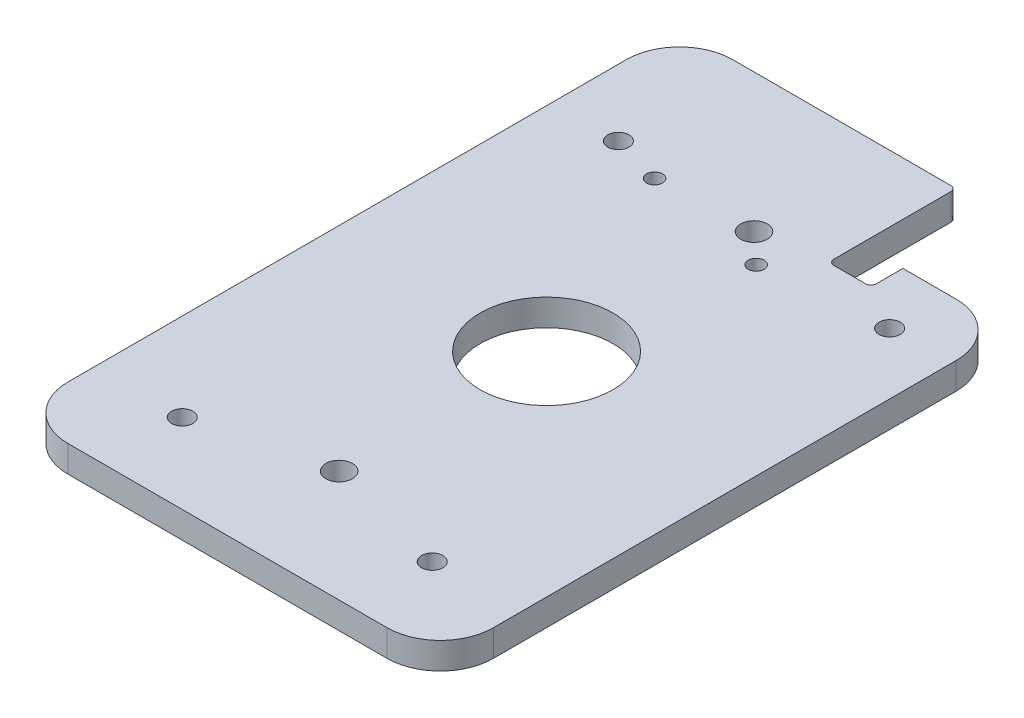
ISO-10303-21;
HEADER;
FILE_DESCRIPTION(('STEP AP214'),'2;1');
FILE_NAME('part.step','',(''),(''),'','','');
FILE_SCHEMA(('AUTOMOTIVE_DESIGN { 1 0 10303 214 1 1 1 1 }'));
ENDSEC;
DATA;
#1=APPLICATION_CONTEXT('core data for automotive mechanical design processes');
#2=APPLICATION_PROTOCOL_DEFINITION('international standard','automotive_design',2000,#1);
#3=PRODUCT_CONTEXT('',#1,'mechanical');
#4=PRODUCT('Part','Part','',(#3));
#5=PRODUCT_RELATED_PRODUCT_CATEGORY('part','',(#4));
#6=PRODUCT_DEFINITION_FORMATION('','',#4);
#7=PRODUCT_DEFINITION_CONTEXT('part definition',#1,'design');
#8=PRODUCT_DEFINITION('design','',#6,#7);
#9=PRODUCT_DEFINITION_SHAPE('','',#8);
#10=(LENGTH_UNIT() NAMED_UNIT(*) SI_UNIT(.MILLI.,.METRE.));
#11=(NAMED_UNIT(*) PLANE_ANGLE_UNIT() SI_UNIT($,.RADIAN.));
#12=(NAMED_UNIT(*) SI_UNIT($,.STERADIAN.) SOLID_ANGLE_UNIT());
#13=UNCERTAINTY_MEASURE_WITH_UNIT(LENGTH_MEASURE(1.E-05),#10,'distance_accuracy_value','');
#14=(GEOMETRIC_REPRESENTATION_CONTEXT(3) GLOBAL_UNCERTAINTY_ASSIGNED_CONTEXT((#13)) GLOBAL_UNIT_ASSIGNED_CONTEXT((#10,
#11,#12)) REPRESENTATION_CONTEXT('',''));
#15=CARTESIAN_POINT('',(0.,0.,0.));
#16=DIRECTION('',(0.,0.,1.));
#17=DIRECTION('',(1.,0.,0.));
#18=AXIS2_PLACEMENT_3D('',#15,#16,#17);
#19=CARTESIAN_POINT('',(0.,5.,0.));
#20=DIRECTION('',(0.,1.,0.));
#21=DIRECTION('',(0.,0.,1.));
#22=AXIS2_PLACEMENT_3D('',#19,#20,#21);
#23=PLANE('',#22);
#24=DIRECTION('',(0.,0.,1.));
#25=VECTOR('',#24,1.);
#26=CARTESIAN_POINT('',(12.,5.,-65.));
#27=LINE('',#26,#25);
#28=CARTESIAN_POINT('',(12.,5.,-64.));
#29=VERTEX_POINT('',#28);
#30=CARTESIAN_POINT('',(12.,5.,-42.));
#31=VERTEX_POINT('',#30);
#32=EDGE_CURVE('E177',#29,#31,#27,.T.);
#33=ORIENTED_EDGE('',*,*,#32,.F.);
#34=CARTESIAN_POINT('',(11.,5.,-64.));
#35=DIRECTION('',(0.,1.,0.));
#36=DIRECTION('',(0.,0.,1.));
#37=AXIS2_PLACEMENT_3D('',#34,#35,#36);
#38=CIRCLE('',#37,1.);
#39=CARTESIAN_POINT('',(11.,5.,-65.));
#40=VERTEX_POINT('',#39);
#41=EDGE_CURVE('E56',#29,#40,#38,.T.);
#42=ORIENTED_EDGE('',*,*,#41,.T.);
#43=DIRECTION('',(-1.,0.,0.));
#44=VECTOR('',#43,1.);
#45=CARTESIAN_POINT('',(-40.,5.,-65.));
#46=LINE('',#45,#44);
#47=CARTESIAN_POINT('',(-30.,5.,-65.));
#48=VERTEX_POINT('',#47);
#49=EDGE_CURVE('E195',#40,#48,#46,.T.);
#50=ORIENTED_EDGE('',*,*,#49,.T.);
#51=CARTESIAN_POINT('',(-30.,5.,-55.));
#52=DIRECTION('',(0.,1.,0.));
#53=DIRECTION('',(0.,0.,1.));
#54=AXIS2_PLACEMENT_3D('',#51,#52,#53);
#55=CIRCLE('',#54,10.);
#56=CARTESIAN_POINT('',(-40.,5.,-55.));
#57=VERTEX_POINT('',#56);
#58=EDGE_CURVE('E212',#48,#57,#55,.T.);
#59=ORIENTED_EDGE('',*,*,#58,.T.);
#60=DIRECTION('',(0.,0.,1.));
#61=VECTOR('',#60,1.);
#62=CARTESIAN_POINT('',(-40.,5.,-65.));
#63=LINE('',#62,#61);
#64=CARTESIAN_POINT('',(-40.,5.,50.));
#65=VERTEX_POINT('',#64);
#66=EDGE_CURVE('E185',#57,#65,#63,.T.);
#67=ORIENTED_EDGE('',*,*,#66,.T.);
#68=CARTESIAN_POINT('',(-30.,5.,50.));
#69=DIRECTION('',(0.,1.,0.));
#70=DIRECTION('',(0.,0.,1.));
#71=AXIS2_PLACEMENT_3D('',#68,#69,#70);
#72=CIRCLE('',#71,10.);
#73=CARTESIAN_POINT('',(-30.,5.,60.));
#74=VERTEX_POINT('',#73);
#75=EDGE_CURVE('E214',#65,#74,#72,.T.);
#76=ORIENTED_EDGE('',*,*,#75,.T.);
#77=DIRECTION('',(1.,0.,0.));
#78=VECTOR('',#77,1.);
#79=CARTESIAN_POINT('',(-40.,5.,60.));
#80=LINE('',#79,#78);
#81=CARTESIAN_POINT('',(30.,5.,60.));
#82=VERTEX_POINT('',#81);
#83=EDGE_CURVE('E188',#74,#82,#80,.T.);
#84=ORIENTED_EDGE('',*,*,#83,.T.);
#85=CARTESIAN_POINT('',(30.,5.,50.));
#86=DIRECTION('',(0.,1.,0.));
#87=DIRECTION('',(0.,0.,1.));
#88=AXIS2_PLACEMENT_3D('',#85,#86,#87);
#89=CIRCLE('',#88,10.);
#90=CARTESIAN_POINT('',(40.,5.,50.));
#91=VERTEX_POINT('',#90);
#92=EDGE_CURVE('E216',#82,#91,#89,.T.);
#93=ORIENTED_EDGE('',*,*,#92,.T.);
#94=DIRECTION('',(0.,0.,-1.));
#95=VECTOR('',#94,1.);
#96=CARTESIAN_POINT('',(40.,5.,-65.));
#97=LINE('',#96,#95);
#98=CARTESIAN_POINT('',(40.,5.,-37.));
#99=VERTEX_POINT('',#98);
#100=EDGE_CURVE('E192',#91,#99,#97,.T.);
#101=ORIENTED_EDGE('',*,*,#100,.T.);
#102=CARTESIAN_POINT('',(30.,5.,-37.));
#103=DIRECTION('',(0.,1.,0.));
#104=DIRECTION('',(0.,0.,1.));
#105=AXIS2_PLACEMENT_3D('',#102,#103,#104);
#106=CIRCLE('',#105,10.);
#107=CARTESIAN_POINT('',(30.,5.,-47.));
#108=VERTEX_POINT('',#107);
#109=EDGE_CURVE('E218',#99,#108,#106,.T.);
#110=ORIENTED_EDGE('',*,*,#109,.T.);
#111=DIRECTION('',(1.,0.,0.));
#112=VECTOR('',#111,1.);
#113=CARTESIAN_POINT('',(12.,5.,-47.));
#114=LINE('',#113,#112);
#115=CARTESIAN_POINT('',(20.,5.,-47.));
#116=VERTEX_POINT('',#115);
#117=EDGE_CURVE('E173',#116,#108,#114,.T.);
#118=ORIENTED_EDGE('',*,*,#117,.F.);
#119=DIRECTION('',(0.,0.,-1.));
#120=VECTOR('',#119,1.);
#121=CARTESIAN_POINT('',(20.,5.,-47.));
#122=LINE('',#121,#120);
#123=CARTESIAN_POINT('',(20.,5.,-42.));
#124=VERTEX_POINT('',#123);
#125=EDGE_CURVE('E157',#124,#116,#122,.T.);
#126=ORIENTED_EDGE('',*,*,#125,.F.);
#127=CARTESIAN_POINT('',(19.,5.,-42.));
#128=DIRECTION('',(0.,1.,0.));
#129=DIRECTION('',(0.,0.,1.));
#130=AXIS2_PLACEMENT_3D('',#127,#128,#129);
#131=CIRCLE('',#130,1.);
#132=CARTESIAN_POINT('',(19.,5.,-41.));
#133=VERTEX_POINT('',#132);
#134=EDGE_CURVE('E260',#124,#133,#131,.F.);
#135=ORIENTED_EDGE('',*,*,#134,.T.);
#136=DIRECTION('',(1.,0.,0.));
#137=VECTOR('',#136,1.);
#138=CARTESIAN_POINT('',(12.,5.,-41.));
#139=LINE('',#138,#137);
#140=CARTESIAN_POINT('',(13.,5.,-41.));
#141=VERTEX_POINT('',#140);
#142=EDGE_CURVE('E265',#141,#133,#139,.T.);
#143=ORIENTED_EDGE('',*,*,#142,.F.);
#144=CARTESIAN_POINT('',(13.,5.,-42.));
#145=DIRECTION('',(0.,1.,0.));
#146=DIRECTION('',(0.,0.,1.));
#147=AXIS2_PLACEMENT_3D('',#144,#145,#146);
#148=CIRCLE('',#147,1.);
#149=EDGE_CURVE('E41',#141,#31,#148,.F.);
#150=ORIENTED_EDGE('',*,*,#149,.T.);
#151=EDGE_LOOP('',(#33,#42,#50,#59,#67,#76,#84,#93,#101,#110,#118,#126,#135,#143,#150));
#152=FACE_BOUND('',#151,.T.);
#153=CARTESIAN_POINT('',(5.60943135797618,5.,-33.8));
#154=DIRECTION('',(0.,1.,0.));
#155=DIRECTION('',(0.,0.,1.));
#156=AXIS2_PLACEMENT_3D('',#153,#154,#155);
#157=CIRCLE('',#156,1.49999999999999);
#158=CARTESIAN_POINT('',(5.60943135797618,5.,-32.3));
#159=VERTEX_POINT('',#158);
#160=EDGE_CURVE('E160',#159,#159,#157,.T.);
#161=ORIENTED_EDGE('',*,*,#160,.F.);
#162=EDGE_LOOP('',(#161));
#163=FACE_BOUND('',#162,.T.);
#164=CARTESIAN_POINT('',(-18.,5.,-38.3));
#165=DIRECTION('',(0.,1.,0.));
#166=DIRECTION('',(0.,0.,1.));
#167=AXIS2_PLACEMENT_3D('',#164,#165,#166);
#168=CIRCLE('',#167,1.49999999999999);
#169=CARTESIAN_POINT('',(-18.,5.,-36.8));
#170=VERTEX_POINT('',#169);
#171=EDGE_CURVE('E288',#170,#170,#168,.T.);
#172=ORIENTED_EDGE('',*,*,#171,.F.);
#173=EDGE_LOOP('',(#172));
#174=FACE_BOUND('',#173,.T.);
#175=CARTESIAN_POINT('',(0.,5.,39.));
#176=DIRECTION('',(0.,1.,0.));
#177=DIRECTION('',(0.,0.,1.));
#178=AXIS2_PLACEMENT_3D('',#175,#176,#177);
#179=CIRCLE('',#178,2.5);
#180=CARTESIAN_POINT('',(0.,5.,41.5));
#181=VERTEX_POINT('',#180);
#182=EDGE_CURVE('E294',#181,#181,#179,.T.);
#183=ORIENTED_EDGE('',*,*,#182,.F.);
#184=EDGE_LOOP('',(#183));
#185=FACE_BOUND('',#184,.T.);
#186=CARTESIAN_POINT('',(0.,5.,-39.));
#187=DIRECTION('',(0.,1.,0.));
#188=DIRECTION('',(0.,0.,1.));
#189=AXIS2_PLACEMENT_3D('',#186,#187,#188);
#190=CIRCLE('',#189,2.5);
#191=CARTESIAN_POINT('',(0.,5.,-36.5));
#192=VERTEX_POINT('',#191);
#193=EDGE_CURVE('E300',#192,#192,#190,.T.);
#194=ORIENTED_EDGE('',*,*,#193,.F.);
#195=EDGE_LOOP('',(#194));
#196=FACE_BOUND('',#195,.T.);
#197=CARTESIAN_POINT('',(-23.4999999999885,5.,45.));
#198=DIRECTION('',(0.,1.,0.));
#199=DIRECTION('',(0.,0.,1.));
#200=AXIS2_PLACEMENT_3D('',#197,#198,#199);
#201=CIRCLE('',#200,1.99999999999999);
#202=CARTESIAN_POINT('',(-23.4999999999885,5.,47.));
#203=VERTEX_POINT('',#202);
#204=EDGE_CURVE('E306',#203,#203,#201,.T.);
#205=ORIENTED_EDGE('',*,*,#204,.F.);
#206=EDGE_LOOP('',(#205));
#207=FACE_BOUND('',#206,.T.);
#208=CARTESIAN_POINT('',(23.4999999999885,5.,45.));
#209=DIRECTION('',(0.,1.,0.));
#210=DIRECTION('',(0.,0.,1.));
#211=AXIS2_PLACEMENT_3D('',#208,#209,#210);
#212=CIRCLE('',#211,1.99999999999999);
#213=CARTESIAN_POINT('',(23.4999999999885,5.,47.));
#214=VERTEX_POINT('',#213);
#215=EDGE_CURVE('E312',#214,#214,#212,.T.);
#216=ORIENTED_EDGE('',*,*,#215,.F.);
#217=EDGE_LOOP('',(#216));
#218=FACE_BOUND('',#217,.T.);
#219=CARTESIAN_POINT('',(28.4999999999885,5.,-36.));
#220=DIRECTION('',(0.,1.,0.));
#221=DIRECTION('',(0.,0.,1.));
#222=AXIS2_PLACEMENT_3D('',#219,#220,#221);
#223=CIRCLE('',#222,1.99999999999999);
#224=CARTESIAN_POINT('',(28.4999999999885,5.,-34.));
#225=VERTEX_POINT('',#224);
#226=EDGE_CURVE('E318',#225,#225,#223,.T.);
#227=ORIENTED_EDGE('',*,*,#226,.F.);
#228=EDGE_LOOP('',(#227));
#229=FACE_BOUND('',#228,.T.);
#230=CARTESIAN_POINT('',(-27.4999999999885,5.,-41.));
#231=DIRECTION('',(0.,1.,0.));
#232=DIRECTION('',(0.,0.,1.));
#233=AXIS2_PLACEMENT_3D('',#230,#231,#232);
#234=CIRCLE('',#233,1.99999999999999);
#235=CARTESIAN_POINT('',(-27.4999999999885,5.,-39.));
#236=VERTEX_POINT('',#235);
#237=EDGE_CURVE('E324',#236,#236,#234,.T.);
#238=ORIENTED_EDGE('',*,*,#237,.F.);
#239=EDGE_LOOP('',(#238));
#240=FACE_BOUND('',#239,.T.);
#241=CARTESIAN_POINT('',(0.,5.,0.));
#242=DIRECTION('',(0.,1.,0.));
#243=DIRECTION('',(0.,0.,1.));
#244=AXIS2_PLACEMENT_3D('',#241,#242,#243);
#245=CIRCLE('',#244,12.5);
#246=CARTESIAN_POINT('',(0.,5.,12.5));
#247=VERTEX_POINT('',#246);
#248=EDGE_CURVE('E170',#247,#247,#245,.T.);
#249=ORIENTED_EDGE('',*,*,#248,.F.);
#250=EDGE_LOOP('',(#249));
#251=FACE_BOUND('',#250,.T.);
#252=ADVANCED_FACE('F33',(#152,#163,#174,#185,#196,#207,#218,#229,#240,#251),#23,.T.);
#253=CARTESIAN_POINT('',(0.,0.,0.));
#254=DIRECTION('',(0.,1.,0.));
#255=DIRECTION('',(0.,0.,1.));
#256=AXIS2_PLACEMENT_3D('',#253,#254,#255);
#257=PLANE('',#256);
#258=DIRECTION('',(-1.,0.,0.));
#259=VECTOR('',#258,1.);
#260=CARTESIAN_POINT('',(-40.,0.,-65.));
#261=LINE('',#260,#259);
#262=CARTESIAN_POINT('',(11.,0.,-65.));
#263=VERTEX_POINT('',#262);
#264=CARTESIAN_POINT('',(-30.,0.,-65.));
#265=VERTEX_POINT('',#264);
#266=EDGE_CURVE('E189',#263,#265,#261,.T.);
#267=ORIENTED_EDGE('',*,*,#266,.F.);
#268=CARTESIAN_POINT('',(11.,0.,-64.));
#269=DIRECTION('',(0.,1.,0.));
#270=DIRECTION('',(0.,0.,1.));
#271=AXIS2_PLACEMENT_3D('',#268,#269,#270);
#272=CIRCLE('',#271,1.);
#273=CARTESIAN_POINT('',(12.,0.,-64.));
#274=VERTEX_POINT('',#273);
#275=EDGE_CURVE('E258',#263,#274,#272,.F.);
#276=ORIENTED_EDGE('',*,*,#275,.T.);
#277=DIRECTION('',(0.,0.,1.));
#278=VECTOR('',#277,1.);
#279=CARTESIAN_POINT('',(12.,0.,-65.));
#280=LINE('',#279,#278);
#281=CARTESIAN_POINT('',(12.,0.,-42.));
#282=VERTEX_POINT('',#281);
#283=EDGE_CURVE('E167',#274,#282,#280,.T.);
#284=ORIENTED_EDGE('',*,*,#283,.T.);
#285=CARTESIAN_POINT('',(13.,0.,-42.));
#286=DIRECTION('',(0.,1.,0.));
#287=DIRECTION('',(0.,0.,1.));
#288=AXIS2_PLACEMENT_3D('',#285,#286,#287);
#289=CIRCLE('',#288,1.);
#290=CARTESIAN_POINT('',(13.,0.,-41.));
#291=VERTEX_POINT('',#290);
#292=EDGE_CURVE('E11',#282,#291,#289,.T.);
#293=ORIENTED_EDGE('',*,*,#292,.T.);
#294=DIRECTION('',(1.,0.,0.));
#295=VECTOR('',#294,1.);
#296=CARTESIAN_POINT('',(12.,0.,-41.));
#297=LINE('',#296,#295);
#298=CARTESIAN_POINT('',(19.,0.,-41.));
#299=VERTEX_POINT('',#298);
#300=EDGE_CURVE('E152',#291,#299,#297,.T.);
#301=ORIENTED_EDGE('',*,*,#300,.T.);
#302=CARTESIAN_POINT('',(19.,0.,-42.));
#303=DIRECTION('',(0.,1.,0.));
#304=DIRECTION('',(0.,0.,1.));
#305=AXIS2_PLACEMENT_3D('',#302,#303,#304);
#306=CIRCLE('',#305,1.);
#307=CARTESIAN_POINT('',(20.,0.,-42.));
#308=VERTEX_POINT('',#307);
#309=EDGE_CURVE('E147',#299,#308,#306,.T.);
#310=ORIENTED_EDGE('',*,*,#309,.T.);
#311=DIRECTION('',(0.,0.,-1.));
#312=VECTOR('',#311,1.);
#313=CARTESIAN_POINT('',(20.,0.,-47.));
#314=LINE('',#313,#312);
#315=CARTESIAN_POINT('',(20.,0.,-47.));
#316=VERTEX_POINT('',#315);
#317=EDGE_CURVE('E138',#308,#316,#314,.T.);
#318=ORIENTED_EDGE('',*,*,#317,.T.);
#319=DIRECTION('',(1.,0.,0.));
#320=VECTOR('',#319,1.);
#321=CARTESIAN_POINT('',(12.,0.,-47.));
#322=LINE('',#321,#320);
#323=CARTESIAN_POINT('',(30.,0.,-47.));
#324=VERTEX_POINT('',#323);
#325=EDGE_CURVE('E143',#316,#324,#322,.T.);
#326=ORIENTED_EDGE('',*,*,#325,.T.);
#327=CARTESIAN_POINT('',(30.,0.,-37.));
#328=DIRECTION('',(0.,1.,0.));
#329=DIRECTION('',(0.,0.,1.));
#330=AXIS2_PLACEMENT_3D('',#327,#328,#329);
#331=CIRCLE('',#330,10.);
#332=CARTESIAN_POINT('',(40.,0.,-37.));
#333=VERTEX_POINT('',#332);
#334=EDGE_CURVE('E229',#324,#333,#331,.F.);
#335=ORIENTED_EDGE('',*,*,#334,.T.);
#336=DIRECTION('',(0.,0.,-1.));
#337=VECTOR('',#336,1.);
#338=CARTESIAN_POINT('',(40.,0.,-65.));
#339=LINE('',#338,#337);
#340=CARTESIAN_POINT('',(40.,0.,50.));
#341=VERTEX_POINT('',#340);
#342=EDGE_CURVE('E203',#341,#333,#339,.T.);
#343=ORIENTED_EDGE('',*,*,#342,.F.);
#344=CARTESIAN_POINT('',(30.,0.,50.));
#345=DIRECTION('',(0.,1.,0.));
#346=DIRECTION('',(0.,0.,1.));
#347=AXIS2_PLACEMENT_3D('',#344,#345,#346);
#348=CIRCLE('',#347,10.);
#349=CARTESIAN_POINT('',(30.,0.,60.));
#350=VERTEX_POINT('',#349);
#351=EDGE_CURVE('E227',#341,#350,#348,.F.);
#352=ORIENTED_EDGE('',*,*,#351,.T.);
#353=DIRECTION('',(1.,0.,0.));
#354=VECTOR('',#353,1.);
#355=CARTESIAN_POINT('',(-40.,0.,60.));
#356=LINE('',#355,#354);
#357=CARTESIAN_POINT('',(-30.,0.,60.));
#358=VERTEX_POINT('',#357);
#359=EDGE_CURVE('E200',#358,#350,#356,.T.);
#360=ORIENTED_EDGE('',*,*,#359,.F.);
#361=CARTESIAN_POINT('',(-30.,0.,50.));
#362=DIRECTION('',(0.,1.,0.));
#363=DIRECTION('',(0.,0.,1.));
#364=AXIS2_PLACEMENT_3D('',#361,#362,#363);
#365=CIRCLE('',#364,10.);
#366=CARTESIAN_POINT('',(-40.,0.,50.));
#367=VERTEX_POINT('',#366);
#368=EDGE_CURVE('E225',#358,#367,#365,.F.);
#369=ORIENTED_EDGE('',*,*,#368,.T.);
#370=DIRECTION('',(0.,0.,1.));
#371=VECTOR('',#370,1.);
#372=CARTESIAN_POINT('',(-40.,0.,-65.));
#373=LINE('',#372,#371);
#374=CARTESIAN_POINT('',(-40.,0.,-55.));
#375=VERTEX_POINT('',#374);
#376=EDGE_CURVE('E183',#375,#367,#373,.T.);
#377=ORIENTED_EDGE('',*,*,#376,.F.);
#378=CARTESIAN_POINT('',(-30.,0.,-55.));
#379=DIRECTION('',(0.,1.,0.));
#380=DIRECTION('',(0.,0.,1.));
#381=AXIS2_PLACEMENT_3D('',#378,#379,#380);
#382=CIRCLE('',#381,10.);
#383=EDGE_CURVE('E222',#375,#265,#382,.F.);
#384=ORIENTED_EDGE('',*,*,#383,.T.);
#385=EDGE_LOOP('',(#267,#276,#284,#293,#301,#310,#318,#326,#335,#343,#352,#360,#369,#377,#384));
#386=FACE_BOUND('',#385,.T.);
#387=CARTESIAN_POINT('',(5.60943135797618,0.,-33.8));
#388=DIRECTION('',(0.,1.,0.));
#389=DIRECTION('',(0.,0.,1.));
#390=AXIS2_PLACEMENT_3D('',#387,#388,#389);
#391=CIRCLE('',#390,1.49999999999999);
#392=CARTESIAN_POINT('',(5.60943135797618,0.,-32.3));
#393=VERTEX_POINT('',#392);
#394=EDGE_CURVE('E285',#393,#393,#391,.T.);
#395=ORIENTED_EDGE('',*,*,#394,.T.);
#396=EDGE_LOOP('',(#395));
#397=FACE_BOUND('',#396,.T.);
#398=CARTESIAN_POINT('',(-18.,0.,-38.3));
#399=DIRECTION('',(0.,1.,0.));
#400=DIRECTION('',(0.,0.,1.));
#401=AXIS2_PLACEMENT_3D('',#398,#399,#400);
#402=CIRCLE('',#401,1.49999999999999);
#403=CARTESIAN_POINT('',(-18.,0.,-36.8));
#404=VERTEX_POINT('',#403);
#405=EDGE_CURVE('E291',#404,#404,#402,.T.);
#406=ORIENTED_EDGE('',*,*,#405,.T.);
#407=EDGE_LOOP('',(#406));
#408=FACE_BOUND('',#407,.T.);
#409=CARTESIAN_POINT('',(0.,0.,39.));
#410=DIRECTION('',(0.,1.,0.));
#411=DIRECTION('',(0.,0.,1.));
#412=AXIS2_PLACEMENT_3D('',#409,#410,#411);
#413=CIRCLE('',#412,2.5);
#414=CARTESIAN_POINT('',(0.,0.,41.5));
#415=VERTEX_POINT('',#414);
#416=EDGE_CURVE('E297',#415,#415,#413,.T.);
#417=ORIENTED_EDGE('',*,*,#416,.T.);
#418=EDGE_LOOP('',(#417));
#419=FACE_BOUND('',#418,.T.);
#420=CARTESIAN_POINT('',(0.,0.,-39.));
#421=DIRECTION('',(0.,1.,0.));
#422=DIRECTION('',(0.,0.,1.));
#423=AXIS2_PLACEMENT_3D('',#420,#421,#422);
#424=CIRCLE('',#423,2.5);
#425=CARTESIAN_POINT('',(0.,0.,-36.5));
#426=VERTEX_POINT('',#425);
#427=EDGE_CURVE('E303',#426,#426,#424,.T.);
#428=ORIENTED_EDGE('',*,*,#427,.T.);
#429=EDGE_LOOP('',(#428));
#430=FACE_BOUND('',#429,.T.);
#431=CARTESIAN_POINT('',(-23.4999999999885,0.,45.));
#432=DIRECTION('',(0.,1.,0.));
#433=DIRECTION('',(0.,0.,1.));
#434=AXIS2_PLACEMENT_3D('',#431,#432,#433);
#435=CIRCLE('',#434,1.99999999999999);
#436=CARTESIAN_POINT('',(-23.4999999999885,0.,47.));
#437=VERTEX_POINT('',#436);
#438=EDGE_CURVE('E309',#437,#437,#435,.T.);
#439=ORIENTED_EDGE('',*,*,#438,.T.);
#440=EDGE_LOOP('',(#439));
#441=FACE_BOUND('',#440,.T.);
#442=CARTESIAN_POINT('',(23.4999999999885,0.,45.));
#443=DIRECTION('',(0.,1.,0.));
#444=DIRECTION('',(0.,0.,1.));
#445=AXIS2_PLACEMENT_3D('',#442,#443,#444);
#446=CIRCLE('',#445,1.99999999999999);
#447=CARTESIAN_POINT('',(23.4999999999885,0.,47.));
#448=VERTEX_POINT('',#447);
#449=EDGE_CURVE('E315',#448,#448,#446,.T.);
#450=ORIENTED_EDGE('',*,*,#449,.T.);
#451=EDGE_LOOP('',(#450));
#452=FACE_BOUND('',#451,.T.);
#453=CARTESIAN_POINT('',(28.4999999999885,0.,-36.));
#454=DIRECTION('',(0.,1.,0.));
#455=DIRECTION('',(0.,0.,1.));
#456=AXIS2_PLACEMENT_3D('',#453,#454,#455);
#457=CIRCLE('',#456,1.99999999999999);
#458=CARTESIAN_POINT('',(28.4999999999885,0.,-34.));
#459=VERTEX_POINT('',#458);
#460=EDGE_CURVE('E321',#459,#459,#457,.T.);
#461=ORIENTED_EDGE('',*,*,#460,.T.);
#462=EDGE_LOOP('',(#461));
#463=FACE_BOUND('',#462,.T.);
#464=CARTESIAN_POINT('',(-27.4999999999885,0.,-41.));
#465=DIRECTION('',(0.,1.,0.));
#466=DIRECTION('',(0.,0.,1.));
#467=AXIS2_PLACEMENT_3D('',#464,#465,#466);
#468=CIRCLE('',#467,1.99999999999999);
#469=CARTESIAN_POINT('',(-27.4999999999885,0.,-39.));
#470=VERTEX_POINT('',#469);
#471=EDGE_CURVE('E180',#470,#470,#468,.T.);
#472=ORIENTED_EDGE('',*,*,#471,.T.);
#473=EDGE_LOOP('',(#472));
#474=FACE_BOUND('',#473,.T.);
#475=CARTESIAN_POINT('',(0.,0.,0.));
#476=DIRECTION('',(0.,1.,0.));
#477=DIRECTION('',(0.,0.,1.));
#478=AXIS2_PLACEMENT_3D('',#475,#476,#477);
#479=CIRCLE('',#478,12.5);
#480=CARTESIAN_POINT('',(0.,0.,12.5));
#481=VERTEX_POINT('',#480);
#482=EDGE_CURVE('E166',#481,#481,#479,.T.);
#483=ORIENTED_EDGE('',*,*,#482,.T.);
#484=EDGE_LOOP('',(#483));
#485=FACE_BOUND('',#484,.T.);
#486=ADVANCED_FACE('F140',(#386,#397,#408,#419,#430,#441,#452,#463,#474,#485),#257,.F.);
#487=CARTESIAN_POINT('',(-40.,5.,-65.));
#488=DIRECTION('',(1.,0.,0.));
#489=DIRECTION('',(0.,0.,-1.));
#490=AXIS2_PLACEMENT_3D('',#487,#488,#489);
#491=PLANE('',#490);
#492=ORIENTED_EDGE('',*,*,#376,.T.);
#493=DIRECTION('',(0.,-1.,0.));
#494=VECTOR('',#493,1.);
#495=CARTESIAN_POINT('',(-40.,5.,50.));
#496=LINE('',#495,#494);
#497=EDGE_CURVE('E239',#367,#65,#496,.F.);
#498=ORIENTED_EDGE('',*,*,#497,.T.);
#499=ORIENTED_EDGE('',*,*,#66,.F.);
#500=DIRECTION('',(0.,-1.,0.));
#501=VECTOR('',#500,1.);
#502=CARTESIAN_POINT('',(-40.,5.,-55.));
#503=LINE('',#502,#501);
#504=EDGE_CURVE('E236',#57,#375,#503,.T.);
#505=ORIENTED_EDGE('',*,*,#504,.T.);
#506=EDGE_LOOP('',(#492,#498,#499,#505));
#507=FACE_BOUND('',#506,.T.);
#508=ADVANCED_FACE('F350',(#507),#491,.F.);
#509=CARTESIAN_POINT('',(-40.,5.,60.));
#510=DIRECTION('',(0.,0.,-1.));
#511=DIRECTION('',(-1.,0.,0.));
#512=AXIS2_PLACEMENT_3D('',#509,#510,#511);
#513=PLANE('',#512);
#514=ORIENTED_EDGE('',*,*,#359,.T.);
#515=DIRECTION('',(0.,-1.,0.));
#516=VECTOR('',#515,1.);
#517=CARTESIAN_POINT('',(30.,5.,60.));
#518=LINE('',#517,#516);
#519=EDGE_CURVE('E234',#350,#82,#518,.F.);
#520=ORIENTED_EDGE('',*,*,#519,.T.);
#521=ORIENTED_EDGE('',*,*,#83,.F.);
#522=DIRECTION('',(0.,-1.,0.));
#523=VECTOR('',#522,1.);
#524=CARTESIAN_POINT('',(-30.,5.,60.));
#525=LINE('',#524,#523);
#526=EDGE_CURVE('E231',#74,#358,#525,.T.);
#527=ORIENTED_EDGE('',*,*,#526,.T.);
#528=EDGE_LOOP('',(#514,#520,#521,#527));
#529=FACE_BOUND('',#528,.T.);
#530=ADVANCED_FACE('F356',(#529),#513,.F.);
#531=CARTESIAN_POINT('',(40.,5.,-65.));
#532=DIRECTION('',(-1.,0.,0.));
#533=DIRECTION('',(0.,0.,1.));
#534=AXIS2_PLACEMENT_3D('',#531,#532,#533);
#535=PLANE('',#534);
#536=ORIENTED_EDGE('',*,*,#342,.T.);
#537=DIRECTION('',(0.,1.,0.));
#538=VECTOR('',#537,1.);
#539=CARTESIAN_POINT('',(40.,5.,-37.));
#540=LINE('',#539,#538);
#541=EDGE_CURVE('E209',#333,#99,#540,.T.);
#542=ORIENTED_EDGE('',*,*,#541,.T.);
#543=ORIENTED_EDGE('',*,*,#100,.F.);
#544=DIRECTION('',(0.,-1.,0.));
#545=VECTOR('',#544,1.);
#546=CARTESIAN_POINT('',(40.,5.,50.));
#547=LINE('',#546,#545);
#548=EDGE_CURVE('E197',#91,#341,#547,.T.);
#549=ORIENTED_EDGE('',*,*,#548,.T.);
#550=EDGE_LOOP('',(#536,#542,#543,#549));
#551=FACE_BOUND('',#550,.T.);
#552=ADVANCED_FACE('F361',(#551),#535,.F.);
#553=CARTESIAN_POINT('',(-40.,5.,-65.));
#554=DIRECTION('',(0.,0.,1.));
#555=DIRECTION('',(1.,0.,0.));
#556=AXIS2_PLACEMENT_3D('',#553,#554,#555);
#557=PLANE('',#556);
#558=ORIENTED_EDGE('',*,*,#49,.F.);
#559=DIRECTION('',(0.,1.,0.));
#560=VECTOR('',#559,1.);
#561=CARTESIAN_POINT('',(11.,5.,-65.));
#562=LINE('',#561,#560);
#563=EDGE_CURVE('E48',#40,#263,#562,.F.);
#564=ORIENTED_EDGE('',*,*,#563,.T.);
#565=ORIENTED_EDGE('',*,*,#266,.T.);
#566=DIRECTION('',(0.,-1.,0.));
#567=VECTOR('',#566,1.);
#568=CARTESIAN_POINT('',(-30.,5.,-65.));
#569=LINE('',#568,#567);
#570=EDGE_CURVE('E241',#265,#48,#569,.F.);
#571=ORIENTED_EDGE('',*,*,#570,.T.);
#572=EDGE_LOOP('',(#558,#564,#565,#571));
#573=FACE_BOUND('',#572,.T.);
#574=ADVANCED_FACE('F346',(#573),#557,.F.);
#575=CARTESIAN_POINT('',(0.,5.,0.));
#576=DIRECTION('',(0.,-1.,0.));
#577=DIRECTION('',(0.,0.,-1.));
#578=AXIS2_PLACEMENT_3D('',#575,#576,#577);
#579=CYLINDRICAL_SURFACE('',#578,12.5);
#580=ORIENTED_EDGE('',*,*,#248,.T.);
#581=EDGE_LOOP('',(#580));
#582=FACE_BOUND('',#581,.T.);
#583=ORIENTED_EDGE('',*,*,#482,.F.);
#584=EDGE_LOOP('',(#583));
#585=FACE_BOUND('',#584,.T.);
#586=ADVANCED_FACE('F343',(#582,#585),#579,.F.);
#587=CARTESIAN_POINT('',(12.,0.,-65.));
#588=DIRECTION('',(-1.,0.,0.));
#589=DIRECTION('',(0.,0.,1.));
#590=AXIS2_PLACEMENT_3D('',#587,#588,#589);
#591=PLANE('',#590);
#592=ORIENTED_EDGE('',*,*,#32,.T.);
#593=DIRECTION('',(0.,1.,0.));
#594=VECTOR('',#593,1.);
#595=CARTESIAN_POINT('',(12.,0.,-42.));
#596=LINE('',#595,#594);
#597=EDGE_CURVE('E254',#31,#282,#596,.F.);
#598=ORIENTED_EDGE('',*,*,#597,.T.);
#599=ORIENTED_EDGE('',*,*,#283,.F.);
#600=DIRECTION('',(0.,1.,0.));
#601=VECTOR('',#600,1.);
#602=CARTESIAN_POINT('',(12.,0.,-64.));
#603=LINE('',#602,#601);
#604=EDGE_CURVE('E251',#274,#29,#603,.T.);
#605=ORIENTED_EDGE('',*,*,#604,.T.);
#606=EDGE_LOOP('',(#592,#598,#599,#605));
#607=FACE_BOUND('',#606,.T.);
#608=ADVANCED_FACE('F270',(#607),#591,.F.);
#609=CARTESIAN_POINT('',(12.,0.,-47.));
#610=DIRECTION('',(0.,0.,1.));
#611=DIRECTION('',(1.,0.,0.));
#612=AXIS2_PLACEMENT_3D('',#609,#610,#611);
#613=PLANE('',#612);
#614=ORIENTED_EDGE('',*,*,#325,.F.);
#615=DIRECTION('',(0.,1.,0.));
#616=VECTOR('',#615,1.);
#617=CARTESIAN_POINT('',(20.,0.,-47.));
#618=LINE('',#617,#616);
#619=EDGE_CURVE('E151',#316,#116,#618,.T.);
#620=ORIENTED_EDGE('',*,*,#619,.T.);
#621=ORIENTED_EDGE('',*,*,#117,.T.);
#622=DIRECTION('',(0.,1.,0.));
#623=VECTOR('',#622,1.);
#624=CARTESIAN_POINT('',(30.,0.,-47.));
#625=LINE('',#624,#623);
#626=EDGE_CURVE('E164',#108,#324,#625,.F.);
#627=ORIENTED_EDGE('',*,*,#626,.T.);
#628=EDGE_LOOP('',(#614,#620,#621,#627));
#629=FACE_BOUND('',#628,.T.);
#630=ADVANCED_FACE('F162',(#629),#613,.F.);
#631=CARTESIAN_POINT('',(-27.4999999999885,5.,-41.));
#632=DIRECTION('',(0.,1.,0.));
#633=DIRECTION('',(0.,0.,1.));
#634=AXIS2_PLACEMENT_3D('',#631,#632,#633);
#635=CYLINDRICAL_SURFACE('',#634,1.99999999999999);
#636=ORIENTED_EDGE('',*,*,#471,.F.);
#637=EDGE_LOOP('',(#636));
#638=FACE_BOUND('',#637,.T.);
#639=ORIENTED_EDGE('',*,*,#237,.T.);
#640=EDGE_LOOP('',(#639));
#641=FACE_BOUND('',#640,.T.);
#642=ADVANCED_FACE('F331',(#638,#641),#635,.F.);
#643=CARTESIAN_POINT('',(28.4999999999885,5.,-36.));
#644=DIRECTION('',(0.,1.,0.));
#645=DIRECTION('',(0.,0.,1.));
#646=AXIS2_PLACEMENT_3D('',#643,#644,#645);
#647=CYLINDRICAL_SURFACE('',#646,1.99999999999999);
#648=ORIENTED_EDGE('',*,*,#460,.F.);
#649=EDGE_LOOP('',(#648));
#650=FACE_BOUND('',#649,.T.);
#651=ORIENTED_EDGE('',*,*,#226,.T.);
#652=EDGE_LOOP('',(#651));
#653=FACE_BOUND('',#652,.T.);
#654=ADVANCED_FACE('F334',(#650,#653),#647,.F.);
#655=CARTESIAN_POINT('',(23.4999999999885,5.,45.));
#656=DIRECTION('',(0.,1.,0.));
#657=DIRECTION('',(0.,0.,1.));
#658=AXIS2_PLACEMENT_3D('',#655,#656,#657);
#659=CYLINDRICAL_SURFACE('',#658,1.99999999999999);
#660=ORIENTED_EDGE('',*,*,#449,.F.);
#661=EDGE_LOOP('',(#660));
#662=FACE_BOUND('',#661,.T.);
#663=ORIENTED_EDGE('',*,*,#215,.T.);
#664=EDGE_LOOP('',(#663));
#665=FACE_BOUND('',#664,.T.);
#666=ADVANCED_FACE('F476',(#662,#665),#659,.F.);
#667=CARTESIAN_POINT('',(-23.4999999999885,5.,45.));
#668=DIRECTION('',(0.,1.,0.));
#669=DIRECTION('',(0.,0.,1.));
#670=AXIS2_PLACEMENT_3D('',#667,#668,#669);
#671=CYLINDRICAL_SURFACE('',#670,1.99999999999999);
#672=ORIENTED_EDGE('',*,*,#438,.F.);
#673=EDGE_LOOP('',(#672));
#674=FACE_BOUND('',#673,.T.);
#675=ORIENTED_EDGE('',*,*,#204,.T.);
#676=EDGE_LOOP('',(#675));
#677=FACE_BOUND('',#676,.T.);
#678=ADVANCED_FACE('F486',(#674,#677),#671,.F.);
#679=CARTESIAN_POINT('',(0.,5.,-39.));
#680=DIRECTION('',(0.,1.,0.));
#681=DIRECTION('',(0.,0.,1.));
#682=AXIS2_PLACEMENT_3D('',#679,#680,#681);
#683=CYLINDRICAL_SURFACE('',#682,2.5);
#684=ORIENTED_EDGE('',*,*,#427,.F.);
#685=EDGE_LOOP('',(#684));
#686=FACE_BOUND('',#685,.T.);
#687=ORIENTED_EDGE('',*,*,#193,.T.);
#688=EDGE_LOOP('',(#687));
#689=FACE_BOUND('',#688,.T.);
#690=ADVANCED_FACE('F496',(#686,#689),#683,.F.);
#691=CARTESIAN_POINT('',(0.,5.,39.));
#692=DIRECTION('',(0.,1.,0.));
#693=DIRECTION('',(0.,0.,1.));
#694=AXIS2_PLACEMENT_3D('',#691,#692,#693);
#695=CYLINDRICAL_SURFACE('',#694,2.5);
#696=ORIENTED_EDGE('',*,*,#416,.F.);
#697=EDGE_LOOP('',(#696));
#698=FACE_BOUND('',#697,.T.);
#699=ORIENTED_EDGE('',*,*,#182,.T.);
#700=EDGE_LOOP('',(#699));
#701=FACE_BOUND('',#700,.T.);
#702=ADVANCED_FACE('F372',(#698,#701),#695,.F.);
#703=CARTESIAN_POINT('',(30.,5.,-37.));
#704=DIRECTION('',(0.,1.,0.));
#705=DIRECTION('',(0.,0.,1.));
#706=AXIS2_PLACEMENT_3D('',#703,#704,#705);
#707=CYLINDRICAL_SURFACE('',#706,10.);
#708=ORIENTED_EDGE('',*,*,#334,.F.);
#709=ORIENTED_EDGE('',*,*,#626,.F.);
#710=ORIENTED_EDGE('',*,*,#109,.F.);
#711=ORIENTED_EDGE('',*,*,#541,.F.);
#712=EDGE_LOOP('',(#708,#709,#710,#711));
#713=FACE_BOUND('',#712,.T.);
#714=ADVANCED_FACE('F368',(#713),#707,.T.);
#715=CARTESIAN_POINT('',(30.,5.,50.));
#716=DIRECTION('',(0.,-1.,0.));
#717=DIRECTION('',(0.,0.,-1.));
#718=AXIS2_PLACEMENT_3D('',#715,#716,#717);
#719=CYLINDRICAL_SURFACE('',#718,10.);
#720=ORIENTED_EDGE('',*,*,#92,.F.);
#721=ORIENTED_EDGE('',*,*,#519,.F.);
#722=ORIENTED_EDGE('',*,*,#351,.F.);
#723=ORIENTED_EDGE('',*,*,#548,.F.);
#724=EDGE_LOOP('',(#720,#721,#722,#723));
#725=FACE_BOUND('',#724,.T.);
#726=ADVANCED_FACE('F371',(#725),#719,.T.);
#727=CARTESIAN_POINT('',(-30.,5.,50.));
#728=DIRECTION('',(0.,-1.,0.));
#729=DIRECTION('',(0.,0.,-1.));
#730=AXIS2_PLACEMENT_3D('',#727,#728,#729);
#731=CYLINDRICAL_SURFACE('',#730,10.);
#732=ORIENTED_EDGE('',*,*,#75,.F.);
#733=ORIENTED_EDGE('',*,*,#497,.F.);
#734=ORIENTED_EDGE('',*,*,#368,.F.);
#735=ORIENTED_EDGE('',*,*,#526,.F.);
#736=EDGE_LOOP('',(#732,#733,#734,#735));
#737=FACE_BOUND('',#736,.T.);
#738=ADVANCED_FACE('F376',(#737),#731,.T.);
#739=CARTESIAN_POINT('',(-30.,5.,-55.));
#740=DIRECTION('',(0.,-1.,0.));
#741=DIRECTION('',(0.,0.,-1.));
#742=AXIS2_PLACEMENT_3D('',#739,#740,#741);
#743=CYLINDRICAL_SURFACE('',#742,10.);
#744=ORIENTED_EDGE('',*,*,#58,.F.);
#745=ORIENTED_EDGE('',*,*,#570,.F.);
#746=ORIENTED_EDGE('',*,*,#383,.F.);
#747=ORIENTED_EDGE('',*,*,#504,.F.);
#748=EDGE_LOOP('',(#744,#745,#746,#747));
#749=FACE_BOUND('',#748,.T.);
#750=ADVANCED_FACE('F380',(#749),#743,.T.);
#751=CARTESIAN_POINT('',(-18.,5.,-38.3));
#752=DIRECTION('',(0.,1.,0.));
#753=DIRECTION('',(0.,0.,1.));
#754=AXIS2_PLACEMENT_3D('',#751,#752,#753);
#755=CYLINDRICAL_SURFACE('',#754,1.49999999999999);
#756=ORIENTED_EDGE('',*,*,#405,.F.);
#757=EDGE_LOOP('',(#756));
#758=FACE_BOUND('',#757,.T.);
#759=ORIENTED_EDGE('',*,*,#171,.T.);
#760=EDGE_LOOP('',(#759));
#761=FACE_BOUND('',#760,.T.);
#762=ADVANCED_FACE('F384',(#758,#761),#755,.F.);
#763=CARTESIAN_POINT('',(5.60943135797618,5.,-33.8));
#764=DIRECTION('',(0.,1.,0.));
#765=DIRECTION('',(0.,0.,1.));
#766=AXIS2_PLACEMENT_3D('',#763,#764,#765);
#767=CYLINDRICAL_SURFACE('',#766,1.49999999999999);
#768=ORIENTED_EDGE('',*,*,#394,.F.);
#769=EDGE_LOOP('',(#768));
#770=FACE_BOUND('',#769,.T.);
#771=ORIENTED_EDGE('',*,*,#160,.T.);
#772=EDGE_LOOP('',(#771));
#773=FACE_BOUND('',#772,.T.);
#774=ADVANCED_FACE('F437',(#770,#773),#767,.F.);
#775=CARTESIAN_POINT('',(20.,0.,-47.));
#776=DIRECTION('',(1.,0.,0.));
#777=DIRECTION('',(0.,0.,-1.));
#778=AXIS2_PLACEMENT_3D('',#775,#776,#777);
#779=PLANE('',#778);
#780=ORIENTED_EDGE('',*,*,#317,.F.);
#781=DIRECTION('',(0.,1.,0.));
#782=VECTOR('',#781,1.);
#783=CARTESIAN_POINT('',(20.,5.,-42.));
#784=LINE('',#783,#782);
#785=EDGE_CURVE('E244',#308,#124,#784,.T.);
#786=ORIENTED_EDGE('',*,*,#785,.T.);
#787=ORIENTED_EDGE('',*,*,#125,.T.);
#788=ORIENTED_EDGE('',*,*,#619,.F.);
#789=EDGE_LOOP('',(#780,#786,#787,#788));
#790=FACE_BOUND('',#789,.T.);
#791=ADVANCED_FACE('F155',(#790),#779,.F.);
#792=CARTESIAN_POINT('',(12.,0.,-41.));
#793=DIRECTION('',(0.,0.,1.));
#794=DIRECTION('',(1.,0.,0.));
#795=AXIS2_PLACEMENT_3D('',#792,#793,#794);
#796=PLANE('',#795);
#797=ORIENTED_EDGE('',*,*,#142,.T.);
#798=DIRECTION('',(0.,1.,0.));
#799=VECTOR('',#798,1.);
#800=CARTESIAN_POINT('',(19.,0.,-41.));
#801=LINE('',#800,#799);
#802=EDGE_CURVE('E249',#133,#299,#801,.F.);
#803=ORIENTED_EDGE('',*,*,#802,.T.);
#804=ORIENTED_EDGE('',*,*,#300,.F.);
#805=DIRECTION('',(0.,1.,0.));
#806=VECTOR('',#805,1.);
#807=CARTESIAN_POINT('',(13.,5.,-41.));
#808=LINE('',#807,#806);
#809=EDGE_CURVE('E246',#291,#141,#808,.T.);
#810=ORIENTED_EDGE('',*,*,#809,.T.);
#811=EDGE_LOOP('',(#797,#803,#804,#810));
#812=FACE_BOUND('',#811,.T.);
#813=ADVANCED_FACE('F277',(#812),#796,.F.);
#814=CARTESIAN_POINT('',(19.,0.,-42.));
#815=DIRECTION('',(0.,-1.,0.));
#816=DIRECTION('',(0.,0.,-1.));
#817=AXIS2_PLACEMENT_3D('',#814,#815,#816);
#818=CYLINDRICAL_SURFACE('',#817,1.);
#819=ORIENTED_EDGE('',*,*,#309,.F.);
#820=ORIENTED_EDGE('',*,*,#802,.F.);
#821=ORIENTED_EDGE('',*,*,#134,.F.);
#822=ORIENTED_EDGE('',*,*,#785,.F.);
#823=EDGE_LOOP('',(#819,#820,#821,#822));
#824=FACE_BOUND('',#823,.T.);
#825=ADVANCED_FACE('F386',(#824),#818,.F.);
#826=CARTESIAN_POINT('',(13.,0.,-42.));
#827=DIRECTION('',(0.,-1.,0.));
#828=DIRECTION('',(0.,0.,-1.));
#829=AXIS2_PLACEMENT_3D('',#826,#827,#828);
#830=CYLINDRICAL_SURFACE('',#829,1.);
#831=ORIENTED_EDGE('',*,*,#292,.F.);
#832=ORIENTED_EDGE('',*,*,#597,.F.);
#833=ORIENTED_EDGE('',*,*,#149,.F.);
#834=ORIENTED_EDGE('',*,*,#809,.F.);
#835=EDGE_LOOP('',(#831,#832,#833,#834));
#836=FACE_BOUND('',#835,.T.);
#837=ADVANCED_FACE('F274',(#836),#830,.F.);
#838=CARTESIAN_POINT('',(11.,0.,-64.));
#839=DIRECTION('',(0.,1.,0.));
#840=DIRECTION('',(0.,0.,1.));
#841=AXIS2_PLACEMENT_3D('',#838,#839,#840);
#842=CYLINDRICAL_SURFACE('',#841,1.);
#843=ORIENTED_EDGE('',*,*,#275,.F.);
#844=ORIENTED_EDGE('',*,*,#563,.F.);
#845=ORIENTED_EDGE('',*,*,#41,.F.);
#846=ORIENTED_EDGE('',*,*,#604,.F.);
#847=EDGE_LOOP('',(#843,#844,#845,#846));
#848=FACE_BOUND('',#847,.T.);
#849=ADVANCED_FACE('F35',(#848),#842,.T.);
#850=CLOSED_SHELL('',(#252,#486,#508,#530,#552,#574,#586,#608,#630,#642,#654,#666,#678,#690,
#702,#714,#726,#738,#750,#762,#774,#791,#813,#825,#837,#849));
#851=MANIFOLD_SOLID_BREP('B2',#850);
#852=ADVANCED_BREP_SHAPE_REPRESENTATION('',(#18,#851),#14);
#853=SHAPE_DEFINITION_REPRESENTATION(#9,#852);
ENDSEC;
END-ISO-10303-21;
